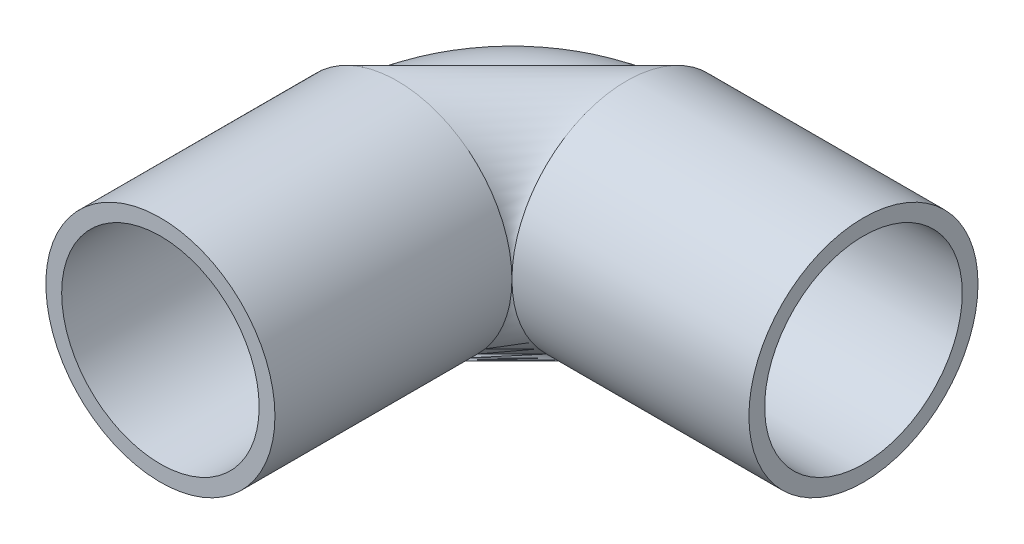
ISO-10303-21;
HEADER;
FILE_DESCRIPTION(('STEP AP214'),'2;1');
FILE_NAME('part.step','',(''),(''),'','','');
FILE_SCHEMA(('AUTOMOTIVE_DESIGN { 1 0 10303 214 1 1 1 1 }'));
ENDSEC;
DATA;
#1=APPLICATION_CONTEXT('core data for automotive mechanical design processes');
#2=APPLICATION_PROTOCOL_DEFINITION('international standard','automotive_design',2000,#1);
#3=PRODUCT_CONTEXT('',#1,'mechanical');
#4=PRODUCT('Part','Part','',(#3));
#5=PRODUCT_RELATED_PRODUCT_CATEGORY('part','',(#4));
#6=PRODUCT_DEFINITION_FORMATION('','',#4);
#7=PRODUCT_DEFINITION_CONTEXT('part definition',#1,'design');
#8=PRODUCT_DEFINITION('design','',#6,#7);
#9=PRODUCT_DEFINITION_SHAPE('','',#8);
#10=(LENGTH_UNIT() NAMED_UNIT(*) SI_UNIT(.MILLI.,.METRE.));
#11=(NAMED_UNIT(*) PLANE_ANGLE_UNIT() SI_UNIT($,.RADIAN.));
#12=(NAMED_UNIT(*) SI_UNIT($,.STERADIAN.) SOLID_ANGLE_UNIT());
#13=UNCERTAINTY_MEASURE_WITH_UNIT(LENGTH_MEASURE(1.E-05),#10,'distance_accuracy_value','');
#14=(GEOMETRIC_REPRESENTATION_CONTEXT(3) GLOBAL_UNCERTAINTY_ASSIGNED_CONTEXT((#13)) GLOBAL_UNIT_ASSIGNED_CONTEXT((#10,
#11,#12)) REPRESENTATION_CONTEXT('',''));
#15=CARTESIAN_POINT('',(0.,0.,0.));
#16=DIRECTION('',(0.,0.,1.));
#17=DIRECTION('',(1.,0.,0.));
#18=AXIS2_PLACEMENT_3D('',#15,#16,#17);
#19=CARTESIAN_POINT('',(0.,0.,30.));
#20=DIRECTION('',(0.,0.,1.));
#21=DIRECTION('',(1.,0.,0.));
#22=AXIS2_PLACEMENT_3D('',#19,#20,#21);
#23=PLANE('',#22);
#24=CARTESIAN_POINT('',(0.,0.,30.));
#25=DIRECTION('',(0.,0.,1.));
#26=DIRECTION('',(1.,0.,0.));
#27=AXIS2_PLACEMENT_3D('',#24,#25,#26);
#28=CIRCLE('',#27,14.5);
#29=CARTESIAN_POINT('',(14.5,0.,30.));
#30=VERTEX_POINT('',#29);
#31=EDGE_CURVE('E11',#30,#30,#28,.T.);
#32=ORIENTED_EDGE('',*,*,#31,.T.);
#33=EDGE_LOOP('',(#32));
#34=FACE_BOUND('',#33,.T.);
#35=CARTESIAN_POINT('',(0.,0.,30.));
#36=DIRECTION('',(0.,0.,1.));
#37=DIRECTION('',(1.,0.,0.));
#38=AXIS2_PLACEMENT_3D('',#35,#36,#37);
#39=CIRCLE('',#38,12.5);
#40=CARTESIAN_POINT('',(12.5,0.,30.));
#41=VERTEX_POINT('',#40);
#42=EDGE_CURVE('E82',#41,#41,#39,.T.);
#43=ORIENTED_EDGE('',*,*,#42,.F.);
#44=EDGE_LOOP('',(#43));
#45=FACE_BOUND('',#44,.T.);
#46=ADVANCED_FACE('F43',(#34,#45),#23,.T.);
#47=CARTESIAN_POINT('',(0.,0.,30.));
#48=DIRECTION('',(0.,0.,-1.));
#49=DIRECTION('',(-1.,0.,0.));
#50=AXIS2_PLACEMENT_3D('',#47,#48,#49);
#51=CYLINDRICAL_SURFACE('',#50,14.5);
#52=ORIENTED_EDGE('',*,*,#31,.F.);
#53=EDGE_LOOP('',(#52));
#54=FACE_BOUND('',#53,.T.);
#55=CARTESIAN_POINT('',(0.,0.,0.));
#56=DIRECTION('',(0.,0.,1.));
#57=DIRECTION('',(1.,0.,0.));
#58=AXIS2_PLACEMENT_3D('',#55,#56,#57);
#59=CIRCLE('',#58,14.5);
#60=CARTESIAN_POINT('',(14.5,0.,0.));
#61=VERTEX_POINT('',#60);
#62=EDGE_CURVE('E52',#61,#61,#59,.T.);
#63=ORIENTED_EDGE('',*,*,#62,.T.);
#64=EDGE_LOOP('',(#63));
#65=FACE_BOUND('',#64,.T.);
#66=ADVANCED_FACE('F45',(#54,#65),#51,.T.);
#67=CARTESIAN_POINT('',(0.,0.,30.));
#68=DIRECTION('',(0.,0.,-1.));
#69=DIRECTION('',(-1.,0.,0.));
#70=AXIS2_PLACEMENT_3D('',#67,#68,#69);
#71=CYLINDRICAL_SURFACE('',#70,12.5);
#72=ORIENTED_EDGE('',*,*,#42,.T.);
#73=EDGE_LOOP('',(#72));
#74=FACE_BOUND('',#73,.T.);
#75=CARTESIAN_POINT('',(-12.5073102399763,0.,0.));
#76=CARTESIAN_POINT('',(-12.5073145811233,-0.204650591903823,0.));
#77=CARTESIAN_POINT('',(-12.5022875183735,-0.409300814418579,0.));
#78=CARTESIAN_POINT('',(-12.4822017557,-0.8181084367157,0.));
#79=CARTESIAN_POINT('',(-12.4671430557762,-1.02226583649807,0.));
#80=CARTESIAN_POINT('',(-12.4270251893742,-1.42959572937615,0.));
#81=CARTESIAN_POINT('',(-12.4019660228959,-1.63276822247187,0.));
#82=CARTESIAN_POINT('',(-12.3419089615572,-2.0376389088724,0.));
#83=CARTESIAN_POINT('',(-12.3069110666967,-2.2393371021772,0.));
#84=CARTESIAN_POINT('',(-12.227060494914,-2.64077326236801,0.));
#85=CARTESIAN_POINT('',(-12.1822078179917,-2.84051122925402,0.));
#86=CARTESIAN_POINT('',(-12.0827558343626,-3.23754575517675,0.));
#87=CARTESIAN_POINT('',(-12.0281565276558,-3.43484231421347,0.));
#88=CARTESIAN_POINT('',(-11.9093427926438,-3.82651871845245,0.));
#89=CARTESIAN_POINT('',(-11.8451283643387,-4.02089856365471,0.));
#90=CARTESIAN_POINT('',(-11.7072390913664,-4.40627326249856,0.));
#91=CARTESIAN_POINT('',(-11.6335642466992,-4.59726811614015,0.));
#92=CARTESIAN_POINT('',(-11.4769316282667,-4.9754127084382,0.));
#93=CARTESIAN_POINT('',(-11.3939738545014,-5.16256244709466,0.));
#94=CARTESIAN_POINT('',(-11.2189752309222,-5.53256594933454,0.));
#95=CARTESIAN_POINT('',(-11.1269343811084,-5.71541971291795,0.));
#96=CARTESIAN_POINT('',(-10.9339913397657,-6.07639075427249,0.));
#97=CARTESIAN_POINT('',(-10.8330891482367,-6.25450803204362,0.));
#98=CARTESIAN_POINT('',(-10.6226665057174,-6.60557700165199,0.));
#99=CARTESIAN_POINT('',(-10.513146054727,-6.77852869348924,0.));
#100=CARTESIAN_POINT('',(-10.2857507376345,-7.11884983545495,0.));
#101=CARTESIAN_POINT('',(-10.1678758715323,-7.28621928558343,0.));
#102=CARTESIAN_POINT('',(-9.92405569509567,-7.61497273646653,0.));
#103=CARTESIAN_POINT('',(-9.79811038476127,-7.77635673722117,0.));
#104=CARTESIAN_POINT('',(-9.53845273314371,-8.09275050116317,0.));
#105=CARTESIAN_POINT('',(-9.40474039186054,-8.24776026435054,0.));
#106=CARTESIAN_POINT('',(-9.12987080308757,-8.55103212106127,0.));
#107=CARTESIAN_POINT('',(-8.98871355559777,-8.69929421458462,0.));
#108=CARTESIAN_POINT('',(-8.69929421458462,-8.98871355559777,0.));
#109=CARTESIAN_POINT('',(-8.55103212106127,-9.12987080308758,0.));
#110=CARTESIAN_POINT('',(-8.24776026435054,-9.40474039186052,0.));
#111=CARTESIAN_POINT('',(-8.09275050116317,-9.53845273314367,0.));
#112=CARTESIAN_POINT('',(-7.77635673722117,-9.79811038476132,0.));
#113=CARTESIAN_POINT('',(-7.61497273646654,-9.92405569509583,0.));
#114=CARTESIAN_POINT('',(-7.28621928558341,-10.1678758715321,0.));
#115=CARTESIAN_POINT('',(-7.11884983545492,-10.2857507376339,0.));
#116=CARTESIAN_POINT('',(-6.77852869348926,-10.5131460547276,0.));
#117=CARTESIAN_POINT('',(-6.6055770016521,-10.6226665057196,0.));
#118=CARTESIAN_POINT('',(-6.25450803204351,-10.8330891482345,0.));
#119=CARTESIAN_POINT('',(-6.07639075427208,-10.9339913397574,0.));
#120=CARTESIAN_POINT('',(-5.71541971291835,-11.1269343811167,0.));
#121=CARTESIAN_POINT('',(-5.53256594933605,-11.2189752309531,0.));
#122=CARTESIAN_POINT('',(-5.16256244709314,-11.3939738544705,0.));
#123=CARTESIAN_POINT('',(-4.97541270843253,-11.4769316281513,0.));
#124=CARTESIAN_POINT('',(-4.59726811614581,-11.6335642468145,0.));
#125=CARTESIAN_POINT('',(-4.4062732625197,-11.7072390917969,0.));
#126=CARTESIAN_POINT('',(-4.02089856363355,-11.8451283639082,0.));
#127=CARTESIAN_POINT('',(-3.82651871837351,-11.9093427910372,0.));
#128=CARTESIAN_POINT('',(-3.43484231429239,-12.0281565292625,0.));
#129=CARTESIAN_POINT('',(-3.23754575547131,-12.0827558403587,0.));
#130=CARTESIAN_POINT('',(-2.84051122895944,-12.1822078119957,0.));
#131=CARTESIAN_POINT('',(-2.64077326126866,-12.2270604725364,0.));
#132=CARTESIAN_POINT('',(-2.23933710327654,-12.3069110890744,0.));
#133=CARTESIAN_POINT('',(-2.0376389129752,-12.3419090450717,0.));
#134=CARTESIAN_POINT('',(-1.63276821836907,-12.4019659393814,0.));
#135=CARTESIAN_POINT('',(-1.42959571406428,-12.4270248776938,0.));
#136=CARTESIAN_POINT('',(-1.02226585180993,-12.4671433674566,0.));
#137=CARTESIAN_POINT('',(-0.818108493860382,-12.4822029189068,0.));
#138=CARTESIAN_POINT('',(-0.409300757273886,-12.5022863551667,0.));
#139=CARTESIAN_POINT('',(-0.204650378636942,-12.5073102399763,0.));
#140=CARTESIAN_POINT('',(0.204650378636946,-12.5073102399763,0.));
#141=CARTESIAN_POINT('',(0.40930075727389,-12.5022863551667,0.));
#142=CARTESIAN_POINT('',(0.818108493860385,-12.4822029189068,0.));
#143=CARTESIAN_POINT('',(1.02226585180994,-12.4671433674566,0.));
#144=CARTESIAN_POINT('',(1.42959571406428,-12.4270248776938,0.));
#145=CARTESIAN_POINT('',(1.63276821836907,-12.4019659393814,0.));
#146=CARTESIAN_POINT('',(2.0376389129752,-12.3419090450717,0.));
#147=CARTESIAN_POINT('',(2.23933710327654,-12.3069110890744,0.));
#148=CARTESIAN_POINT('',(2.64077326126866,-12.2270604725364,0.));
#149=CARTESIAN_POINT('',(2.84051122895945,-12.1822078119957,0.));
#150=CARTESIAN_POINT('',(3.23754575547132,-12.0827558403587,0.));
#151=CARTESIAN_POINT('',(3.4348423142924,-12.0281565292625,0.));
#152=CARTESIAN_POINT('',(3.82651871837352,-11.9093427910372,0.));
#153=CARTESIAN_POINT('',(4.02089856363356,-11.8451283639082,0.));
#154=CARTESIAN_POINT('',(4.40627326251971,-11.7072390917969,0.));
#155=CARTESIAN_POINT('',(4.59726811614582,-11.6335642468145,0.));
#156=CARTESIAN_POINT('',(4.97541270843254,-11.4769316281513,0.));
#157=CARTESIAN_POINT('',(5.16256244709315,-11.3939738544705,0.));
#158=CARTESIAN_POINT('',(5.53256594933606,-11.2189752309531,0.));
#159=CARTESIAN_POINT('',(5.71541971291836,-11.1269343811167,0.));
#160=CARTESIAN_POINT('',(6.07639075427209,-10.9339913397574,0.));
#161=CARTESIAN_POINT('',(6.25450803204351,-10.8330891482345,0.));
#162=CARTESIAN_POINT('',(6.6055770016521,-10.6226665057196,0.));
#163=CARTESIAN_POINT('',(6.77852869348927,-10.5131460547276,0.));
#164=CARTESIAN_POINT('',(7.11884983545493,-10.2857507376339,0.));
#165=CARTESIAN_POINT('',(7.28621928558342,-10.1678758715321,0.));
#166=CARTESIAN_POINT('',(7.61497273646654,-9.92405569509583,0.));
#167=CARTESIAN_POINT('',(7.77635673722117,-9.79811038476132,0.));
#168=CARTESIAN_POINT('',(8.09275050116317,-9.53845273314366,0.));
#169=CARTESIAN_POINT('',(8.24776026435054,-9.40474039186052,0.));
#170=CARTESIAN_POINT('',(8.55103212106127,-9.12987080308758,0.));
#171=CARTESIAN_POINT('',(8.69929421458462,-8.98871355559777,0.));
#172=CARTESIAN_POINT('',(8.98871355559777,-8.69929421458462,0.));
#173=CARTESIAN_POINT('',(9.12987080308758,-8.55103212106127,0.));
#174=CARTESIAN_POINT('',(9.40474039186053,-8.24776026435054,0.));
#175=CARTESIAN_POINT('',(9.53845273314367,-8.09275050116317,0.));
#176=CARTESIAN_POINT('',(9.79811038476132,-7.77635673722116,0.));
#177=CARTESIAN_POINT('',(9.92405569509583,-7.61497273646654,0.));
#178=CARTESIAN_POINT('',(10.1678758715321,-7.28621928558342,0.));
#179=CARTESIAN_POINT('',(10.2857507376339,-7.11884983545492,0.));
#180=CARTESIAN_POINT('',(10.5131460547276,-6.77852869348927,0.));
#181=CARTESIAN_POINT('',(10.6226665057196,-6.6055770016521,0.));
#182=CARTESIAN_POINT('',(10.8330891482345,-6.25450803204351,0.));
#183=CARTESIAN_POINT('',(10.9339913397574,-6.07639075427208,0.));
#184=CARTESIAN_POINT('',(11.1269343811167,-5.71541971291835,0.));
#185=CARTESIAN_POINT('',(11.2189752309531,-5.53256594933605,0.));
#186=CARTESIAN_POINT('',(11.3939738544705,-5.16256244709314,0.));
#187=CARTESIAN_POINT('',(11.4769316281513,-4.97541270843253,0.));
#188=CARTESIAN_POINT('',(11.6335642468145,-4.59726811614581,0.));
#189=CARTESIAN_POINT('',(11.7072390917969,-4.40627326251971,0.));
#190=CARTESIAN_POINT('',(11.8451283639082,-4.02089856363356,0.));
#191=CARTESIAN_POINT('',(11.9093427910372,-3.82651871837352,0.));
#192=CARTESIAN_POINT('',(12.0281565292625,-3.43484231429239,0.));
#193=CARTESIAN_POINT('',(12.0827558403587,-3.23754575547131,0.));
#194=CARTESIAN_POINT('',(12.1822078119957,-2.84051122895945,0.));
#195=CARTESIAN_POINT('',(12.2270604725364,-2.64077326126866,0.));
#196=CARTESIAN_POINT('',(12.3069110890744,-2.23933710327653,0.));
#197=CARTESIAN_POINT('',(12.3419090450717,-2.03763891297519,0.));
#198=CARTESIAN_POINT('',(12.4019659393814,-1.63276821836906,0.));
#199=CARTESIAN_POINT('',(12.4270248776938,-1.42959571406428,0.));
#200=CARTESIAN_POINT('',(12.4671433674566,-1.02226585180994,0.));
#201=CARTESIAN_POINT('',(12.4822029189068,-0.818108493860384,0.));
#202=CARTESIAN_POINT('',(12.5022863551667,-0.409300757273887,0.));
#203=CARTESIAN_POINT('',(12.5073102399763,-0.204650378636943,0.));
#204=CARTESIAN_POINT('',(12.5073102399763,0.204650378636946,0.));
#205=CARTESIAN_POINT('',(12.5022863551667,0.40930075727389,0.));
#206=CARTESIAN_POINT('',(12.4822029189068,0.818108493860388,0.));
#207=CARTESIAN_POINT('',(12.4671433674565,1.02226585180994,0.));
#208=CARTESIAN_POINT('',(12.4270248776938,1.42959571406428,0.));
#209=CARTESIAN_POINT('',(12.4019659393814,1.63276821836907,0.));
#210=CARTESIAN_POINT('',(12.3419090450717,2.03763891297519,0.));
#211=CARTESIAN_POINT('',(12.3069110890744,2.23933710327654,0.));
#212=CARTESIAN_POINT('',(12.2270604725364,2.64077326126866,0.));
#213=CARTESIAN_POINT('',(12.1822078119957,2.84051122895945,0.));
#214=CARTESIAN_POINT('',(12.0827558403587,3.23754575547131,0.));
#215=CARTESIAN_POINT('',(12.0281565292625,3.4348423142924,0.));
#216=CARTESIAN_POINT('',(11.9093427910372,3.82651871837352,0.));
#217=CARTESIAN_POINT('',(11.8451283639082,4.02089856363356,0.));
#218=CARTESIAN_POINT('',(11.7072390917969,4.40627326251971,0.));
#219=CARTESIAN_POINT('',(11.6335642468145,4.59726811614581,0.));
#220=CARTESIAN_POINT('',(11.4769316281513,4.97541270843253,0.));
#221=CARTESIAN_POINT('',(11.3939738544705,5.16256244709314,0.));
#222=CARTESIAN_POINT('',(11.2189752309531,5.53256594933605,0.));
#223=CARTESIAN_POINT('',(11.1269343811167,5.71541971291836,0.));
#224=CARTESIAN_POINT('',(10.9339913397574,6.07639075427209,0.));
#225=CARTESIAN_POINT('',(10.8330891482345,6.25450803204351,0.));
#226=CARTESIAN_POINT('',(10.6226665057196,6.6055770016521,0.));
#227=CARTESIAN_POINT('',(10.5131460547276,6.77852869348927,0.));
#228=CARTESIAN_POINT('',(10.2857507376339,7.11884983545493,0.));
#229=CARTESIAN_POINT('',(10.1678758715321,7.28621928558342,0.));
#230=CARTESIAN_POINT('',(9.92405569509583,7.61497273646654,0.));
#231=CARTESIAN_POINT('',(9.79811038476132,7.77635673722117,0.));
#232=CARTESIAN_POINT('',(9.53845273314367,8.09275050116317,0.));
#233=CARTESIAN_POINT('',(9.40474039186052,8.24776026435054,0.));
#234=CARTESIAN_POINT('',(9.12987080308758,8.55103212106127,0.));
#235=CARTESIAN_POINT('',(8.98871355559777,8.69929421458462,0.));
#236=CARTESIAN_POINT('',(8.69929421458462,8.98871355559777,0.));
#237=CARTESIAN_POINT('',(8.55103212106127,9.12987080308758,0.));
#238=CARTESIAN_POINT('',(8.24776026435054,9.40474039186052,0.));
#239=CARTESIAN_POINT('',(8.09275050116317,9.53845273314367,0.));
#240=CARTESIAN_POINT('',(7.77635673722116,9.79811038476132,0.));
#241=CARTESIAN_POINT('',(7.61497273646654,9.92405569509583,0.));
#242=CARTESIAN_POINT('',(7.28621928558342,10.1678758715321,0.));
#243=CARTESIAN_POINT('',(7.11884983545493,10.2857507376339,0.));
#244=CARTESIAN_POINT('',(6.77852869348927,10.5131460547276,0.));
#245=CARTESIAN_POINT('',(6.6055770016521,10.6226665057196,0.));
#246=CARTESIAN_POINT('',(6.25450803204351,10.8330891482345,0.));
#247=CARTESIAN_POINT('',(6.07639075427208,10.9339913397574,0.));
#248=CARTESIAN_POINT('',(5.71541971291836,11.1269343811167,0.));
#249=CARTESIAN_POINT('',(5.53256594933605,11.2189752309531,0.));
#250=CARTESIAN_POINT('',(5.16256244709314,11.3939738544705,0.));
#251=CARTESIAN_POINT('',(4.97541270843253,11.4769316281513,0.));
#252=CARTESIAN_POINT('',(4.59726811614581,11.6335642468145,0.));
#253=CARTESIAN_POINT('',(4.40627326251971,11.7072390917969,0.));
#254=CARTESIAN_POINT('',(4.02089856363356,11.8451283639082,0.));
#255=CARTESIAN_POINT('',(3.82651871837352,11.9093427910372,0.));
#256=CARTESIAN_POINT('',(3.43484231429239,12.0281565292625,0.));
#257=CARTESIAN_POINT('',(3.23754575547131,12.0827558403587,0.));
#258=CARTESIAN_POINT('',(2.84051122895944,12.1822078119957,0.));
#259=CARTESIAN_POINT('',(2.64077326126866,12.2270604725364,0.));
#260=CARTESIAN_POINT('',(2.23933710327653,12.3069110890744,0.));
#261=CARTESIAN_POINT('',(2.03763891297519,12.3419090450717,0.));
#262=CARTESIAN_POINT('',(1.63276821836906,12.4019659393814,0.));
#263=CARTESIAN_POINT('',(1.42959571406428,12.4270248776938,0.));
#264=CARTESIAN_POINT('',(1.02226585180994,12.4671433674566,0.));
#265=CARTESIAN_POINT('',(0.818108493860387,12.4822029189068,0.));
#266=CARTESIAN_POINT('',(0.409300757273889,12.5022863551667,0.));
#267=CARTESIAN_POINT('',(0.204650378636945,12.5073102399763,0.));
#268=CARTESIAN_POINT('',(-0.204650378636945,12.5073102399763,0.));
#269=CARTESIAN_POINT('',(-0.40930075727389,12.5022863551667,0.));
#270=CARTESIAN_POINT('',(-0.818108493860388,12.4822029189068,0.));
#271=CARTESIAN_POINT('',(-1.02226585180994,12.4671433674565,0.));
#272=CARTESIAN_POINT('',(-1.42959571406428,12.4270248776938,0.));
#273=CARTESIAN_POINT('',(-1.63276821836907,12.4019659393814,0.));
#274=CARTESIAN_POINT('',(-2.03763891297519,12.3419090450717,0.));
#275=CARTESIAN_POINT('',(-2.23933710327653,12.3069110890744,0.));
#276=CARTESIAN_POINT('',(-2.64077326126866,12.2270604725364,0.));
#277=CARTESIAN_POINT('',(-2.84051122895945,12.1822078119957,0.));
#278=CARTESIAN_POINT('',(-3.23754575547131,12.0827558403587,0.));
#279=CARTESIAN_POINT('',(-3.43484231429239,12.0281565292625,0.));
#280=CARTESIAN_POINT('',(-3.82651871837352,11.9093427910372,0.));
#281=CARTESIAN_POINT('',(-4.02089856363356,11.8451283639082,0.));
#282=CARTESIAN_POINT('',(-4.40627326251971,11.7072390917969,0.));
#283=CARTESIAN_POINT('',(-4.59726811614581,11.6335642468145,0.));
#284=CARTESIAN_POINT('',(-4.97541270843253,11.4769316281513,0.));
#285=CARTESIAN_POINT('',(-5.16256244709314,11.3939738544705,0.));
#286=CARTESIAN_POINT('',(-5.53256594933606,11.2189752309531,0.));
#287=CARTESIAN_POINT('',(-5.71541971291836,11.1269343811167,0.));
#288=CARTESIAN_POINT('',(-6.07639075427208,10.9339913397574,0.));
#289=CARTESIAN_POINT('',(-6.25450803204351,10.8330891482345,0.));
#290=CARTESIAN_POINT('',(-6.6055770016521,10.6226665057196,0.));
#291=CARTESIAN_POINT('',(-6.77852869348927,10.5131460547276,0.));
#292=CARTESIAN_POINT('',(-7.11884983545493,10.2857507376339,0.));
#293=CARTESIAN_POINT('',(-7.28621928558342,10.1678758715321,0.));
#294=CARTESIAN_POINT('',(-7.61497273646654,9.92405569509583,0.));
#295=CARTESIAN_POINT('',(-7.77635673722117,9.79811038476132,0.));
#296=CARTESIAN_POINT('',(-8.09275050116317,9.53845273314367,0.));
#297=CARTESIAN_POINT('',(-8.24776026435054,9.40474039186052,0.));
#298=CARTESIAN_POINT('',(-8.55103212106127,9.12987080308758,0.));
#299=CARTESIAN_POINT('',(-8.69929421458462,8.98871355559777,0.));
#300=CARTESIAN_POINT('',(-8.98871355559777,8.69929421458462,0.));
#301=CARTESIAN_POINT('',(-9.12987080308757,8.55103212106127,0.));
#302=CARTESIAN_POINT('',(-9.40474039186054,8.24776026435054,0.));
#303=CARTESIAN_POINT('',(-9.53845273314371,8.09275050116317,0.));
#304=CARTESIAN_POINT('',(-9.79811038476128,7.77635673722116,0.));
#305=CARTESIAN_POINT('',(-9.92405569509567,7.61497273646653,0.));
#306=CARTESIAN_POINT('',(-10.1678758715323,7.28621928558343,0.));
#307=CARTESIAN_POINT('',(-10.2857507376345,7.11884983545496,0.));
#308=CARTESIAN_POINT('',(-10.513146054727,6.77852869348924,0.));
#309=CARTESIAN_POINT('',(-10.6226665057174,6.60557700165199,0.));
#310=CARTESIAN_POINT('',(-10.8330891482367,6.25450803204362,0.));
#311=CARTESIAN_POINT('',(-10.9339913397657,6.07639075427249,0.));
#312=CARTESIAN_POINT('',(-11.1269343811084,5.71541971291795,0.));
#313=CARTESIAN_POINT('',(-11.2189752309222,5.53256594933454,0.));
#314=CARTESIAN_POINT('',(-11.3939738545014,5.16256244709466,0.));
#315=CARTESIAN_POINT('',(-11.4769316282667,4.9754127084382,0.));
#316=CARTESIAN_POINT('',(-11.6335642466992,4.59726811614015,0.));
#317=CARTESIAN_POINT('',(-11.7072390913664,4.40627326249856,0.));
#318=CARTESIAN_POINT('',(-11.8451283643387,4.02089856365471,0.));
#319=CARTESIAN_POINT('',(-11.9093427926438,3.82651871845245,0.));
#320=CARTESIAN_POINT('',(-12.0281565276558,3.43484231421347,0.));
#321=CARTESIAN_POINT('',(-12.0827558343626,3.23754575517674,0.));
#322=CARTESIAN_POINT('',(-12.1822078179917,2.84051122925401,0.));
#323=CARTESIAN_POINT('',(-12.227060494914,2.640773262368,0.));
#324=CARTESIAN_POINT('',(-12.3069110666967,2.23933710217719,0.));
#325=CARTESIAN_POINT('',(-12.3419089615572,2.03763890887239,0.));
#326=CARTESIAN_POINT('',(-12.4019660228959,1.63276822247187,0.));
#327=CARTESIAN_POINT('',(-12.4270251893742,1.42959572937615,0.));
#328=CARTESIAN_POINT('',(-12.4671430557762,1.02226583649807,0.));
#329=CARTESIAN_POINT('',(-12.4822017557,0.8181084367157,0.));
#330=CARTESIAN_POINT('',(-12.5022875183735,0.409300814418577,0.));
#331=CARTESIAN_POINT('',(-12.5073145811233,0.204650591903821,0.));
#332=CARTESIAN_POINT('',(-12.5073102399763,0.,0.));
#333=B_SPLINE_CURVE_WITH_KNOTS('',3,(#75,#76,#77,#78,#79,#80,#81,#82,#83,#84,#85,#86,#87,#88,
#89,#90,#91,#92,#93,#94,#95,#96,#97,#98,#99,#100,#101,#102,#103,#104,#105,#106,#107,#108,#109,
#110,#111,#112,#113,#114,#115,#116,#117,#118,#119,#120,#121,#122,#123,#124,#125,#126,#127,#128,
#129,#130,#131,#132,#133,#134,#135,#136,#137,#138,#139,#140,#141,#142,#143,#144,#145,#146,#147,
#148,#149,#150,#151,#152,#153,#154,#155,#156,#157,#158,#159,#160,#161,#162,#163,#164,#165,#166,
#167,#168,#169,#170,#171,#172,#173,#174,#175,#176,#177,#178,#179,#180,#181,#182,#183,#184,#185,
#186,#187,#188,#189,#190,#191,#192,#193,#194,#195,#196,#197,#198,#199,#200,#201,#202,#203,#204,
#205,#206,#207,#208,#209,#210,#211,#212,#213,#214,#215,#216,#217,#218,#219,#220,#221,#222,#223,
#224,#225,#226,#227,#228,#229,#230,#231,#232,#233,#234,#235,#236,#237,#238,#239,#240,#241,#242,
#243,#244,#245,#246,#247,#248,#249,#250,#251,#252,#253,#254,#255,#256,#257,#258,#259,#260,#261,
#262,#263,#264,#265,#266,#267,#268,#269,#270,#271,#272,#273,#274,#275,#276,#277,#278,#279,#280,
#281,#282,#283,#284,#285,#286,#287,#288,#289,#290,#291,#292,#293,#294,#295,#296,#297,#298,#299,
#300,#301,#302,#303,#304,#305,#306,#307,#308,#309,#310,#311,#312,#313,#314,#315,#316,#317,#318,
#319,#320,#321,#322,#323,#324,#325,#326,#327,#328,#329,#330,#331,#332),.UNSPECIFIED.,.F.,.F.,(4,
2,2,2,2,2,2,2,2,2,2,2,2,2,2,2,2,2,2,2,2,2,2,2,2,2,2,2,2,2,2,2,2,2,2,2,2,2,2,2,2,2,2,2,2,2,2,2,2,
2,2,2,2,2,2,2,2,2,2,2,2,2,2,2,2,2,2,2,2,2,2,2,2,2,2,2,2,2,2,2,2,2,2,2,2,2,2,2,2,2,2,2,2,2,2,2,2,
2,2,2,2,2,2,2,2,2,2,2,2,2,2,2,2,2,2,2,2,2,2,2,2,2,2,2,2,2,2,2,4),(0.,0.613889517612437,
1.22777903522487,1.84166855283732,2.45555807044976,3.0694475880622,3.68333710567463,
4.29722662328707,4.91111614089952,5.52500565851196,6.13889517612439,6.75278469373683,
7.36667421134927,7.9805637289617,8.59445324657415,9.20834276418659,9.82223228179902,
10.4361217994115,11.0500113170239,11.6639008346363,12.2777903522488,12.8916798698612,
13.5055693874737,14.1194589050861,14.7333484226985,15.347237940311,15.9611274579234,
16.5750169755359,17.1889064931483,17.8027960107607,18.4166855283732,19.0305750459856,
19.644464563598,20.2583540812105,20.8722435988229,21.4861331164354,22.1000226340478,
22.7139121516602,23.3278016692727,23.9416911868851,24.5555807044976,25.16947022211,
25.7833597397224,26.3972492573349,27.0111387749473,27.6250282925598,28.2389178101722,
28.8528073277846,29.4666968453971,30.0805863630095,30.694475880622,31.3083653982344,
31.9222549158468,32.5361444334593,33.1500339510717,33.7639234686842,34.3778129862966,
34.991702503909,35.6055920215215,36.2194815391339,36.8333710567464,37.4472605743588,
38.0611500919712,38.6750396095837,39.2889291271961,39.9028186448086,40.516708162421,
41.1305976800335,41.7444871976459,42.3583767152583,42.9722662328708,43.5861557504832,
44.2000452680957,44.8139347857081,45.4278243033205,46.041713820933,46.6556033385454,
47.2694928561579,47.8833823737703,48.4972718913828,49.1111614089952,49.7250509266076,
50.3389404442201,50.9528299618325,51.566719479445,52.1806089970574,52.7944985146698,
53.4083880322823,54.0222775498947,54.6361670675072,55.2500565851196,55.863946102732,
56.4778356203445,57.0917251379569,57.7056146555693,58.3195041731818,58.9333936907942,
59.5472832084067,60.1611727260191,60.7750622436315,61.388951761244,62.0028412788564,
62.6167307964689,63.2306203140813,63.8445098316937,64.4583993493062,65.0722888669186,
65.6861783845311,66.3000679021435,66.9139574197559,67.5278469373684,68.1417364549808,
68.7556259725933,69.3695154902057,69.9834050078182,70.5972945254306,71.211184043043,
71.8250735606555,72.4389630782679,73.0528525958804,73.6667421134928,74.2806316311053,
74.8945211487177,75.5084106663301,76.1223001839426,76.736189701555,77.3500792191675,
77.9639687367799,78.5778582543924),.UNSPECIFIED.);
#334=CARTESIAN_POINT('',(-12.5073102399763,0.,0.));
#335=VERTEX_POINT('',#334);
#336=EDGE_CURVE('E63',#335,#335,#333,.T.);
#337=ORIENTED_EDGE('',*,*,#336,.F.);
#338=EDGE_LOOP('',(#337));
#339=FACE_BOUND('',#338,.T.);
#340=ADVANCED_FACE('F95',(#74,#339),#71,.F.);
#341=CARTESIAN_POINT('',(14.5,0.,0.));
#342=DIRECTION('',(0.,1.,0.));
#343=DIRECTION('',(0.,0.,1.));
#344=AXIS2_PLACEMENT_3D('',#341,#342,#343);
#345=DEGENERATE_TOROIDAL_SURFACE('',#344,14.5,14.5,.T.);
#346=CARTESIAN_POINT('',(14.5,0.,-14.5));
#347=DIRECTION('',(1.,0.,0.));
#348=DIRECTION('',(0.,0.,-1.));
#349=AXIS2_PLACEMENT_3D('',#346,#347,#348);
#350=CIRCLE('',#349,14.5);
#351=EDGE_CURVE('E47',#61,#61,#350,.T.);
#352=ORIENTED_EDGE('',*,*,#351,.F.);
#353=ORIENTED_EDGE('',*,*,#62,.F.);
#354=EDGE_LOOP('',(#352,#353));
#355=FACE_BOUND('',#354,.T.);
#356=ADVANCED_FACE('F94',(#355),#345,.T.);
#357=CARTESIAN_POINT('',(14.5,0.,0.));
#358=DIRECTION('',(0.,1.,0.));
#359=DIRECTION('',(0.,0.,1.));
#360=AXIS2_PLACEMENT_3D('',#357,#358,#359);
#361=TOROIDAL_SURFACE('',#360,14.5,12.5073102399763);
#362=ORIENTED_EDGE('',*,*,#336,.T.);
#363=EDGE_LOOP('',(#362));
#364=FACE_BOUND('',#363,.T.);
#365=CARTESIAN_POINT('',(14.5,0.,-14.5));
#366=DIRECTION('',(1.,0.,0.));
#367=DIRECTION('',(0.,0.,-1.));
#368=AXIS2_PLACEMENT_3D('',#365,#366,#367);
#369=CIRCLE('',#368,12.5073102399763);
#370=CARTESIAN_POINT('',(14.5,0.,-27.0073102399763));
#371=VERTEX_POINT('',#370);
#372=EDGE_CURVE('E60',#371,#371,#369,.F.);
#373=ORIENTED_EDGE('',*,*,#372,.F.);
#374=EDGE_LOOP('',(#373));
#375=FACE_BOUND('',#374,.T.);
#376=ADVANCED_FACE('F83',(#364,#375),#361,.F.);
#377=CARTESIAN_POINT('',(44.5,0.,-14.5));
#378=DIRECTION('',(1.,0.,0.));
#379=DIRECTION('',(0.,0.,-1.));
#380=AXIS2_PLACEMENT_3D('',#377,#378,#379);
#381=PLANE('',#380);
#382=CARTESIAN_POINT('',(44.5,0.,-14.5));
#383=DIRECTION('',(1.,0.,0.));
#384=DIRECTION('',(0.,0.,-1.));
#385=AXIS2_PLACEMENT_3D('',#382,#383,#384);
#386=CIRCLE('',#385,14.5);
#387=CARTESIAN_POINT('',(44.5,0.,-29.));
#388=VERTEX_POINT('',#387);
#389=EDGE_CURVE('E61',#388,#388,#386,.T.);
#390=ORIENTED_EDGE('',*,*,#389,.T.);
#391=EDGE_LOOP('',(#390));
#392=FACE_BOUND('',#391,.T.);
#393=CARTESIAN_POINT('',(44.5,0.,-14.5));
#394=DIRECTION('',(1.,0.,0.));
#395=DIRECTION('',(0.,0.,-1.));
#396=AXIS2_PLACEMENT_3D('',#393,#394,#395);
#397=CIRCLE('',#396,12.5073102399763);
#398=CARTESIAN_POINT('',(44.5,0.,-27.0073102399763));
#399=VERTEX_POINT('',#398);
#400=EDGE_CURVE('E66',#399,#399,#397,.T.);
#401=ORIENTED_EDGE('',*,*,#400,.F.);
#402=EDGE_LOOP('',(#401));
#403=FACE_BOUND('',#402,.T.);
#404=ADVANCED_FACE('F93',(#392,#403),#381,.T.);
#405=CARTESIAN_POINT('',(44.5,0.,-14.5));
#406=DIRECTION('',(-1.,0.,0.));
#407=DIRECTION('',(0.,0.,1.));
#408=AXIS2_PLACEMENT_3D('',#405,#406,#407);
#409=CYLINDRICAL_SURFACE('',#408,14.5);
#410=ORIENTED_EDGE('',*,*,#389,.F.);
#411=EDGE_LOOP('',(#410));
#412=FACE_BOUND('',#411,.T.);
#413=ORIENTED_EDGE('',*,*,#351,.T.);
#414=EDGE_LOOP('',(#413));
#415=FACE_BOUND('',#414,.T.);
#416=ADVANCED_FACE('F57',(#412,#415),#409,.T.);
#417=CARTESIAN_POINT('',(44.5,0.,-14.5));
#418=DIRECTION('',(-1.,0.,0.));
#419=DIRECTION('',(0.,0.,1.));
#420=AXIS2_PLACEMENT_3D('',#417,#418,#419);
#421=CYLINDRICAL_SURFACE('',#420,12.5073102399763);
#422=ORIENTED_EDGE('',*,*,#400,.T.);
#423=EDGE_LOOP('',(#422));
#424=FACE_BOUND('',#423,.T.);
#425=ORIENTED_EDGE('',*,*,#372,.T.);
#426=EDGE_LOOP('',(#425));
#427=FACE_BOUND('',#426,.T.);
#428=ADVANCED_FACE('F152',(#424,#427),#421,.F.);
#429=CLOSED_SHELL('',(#46,#66,#340,#356,#376,#404,#416,#428));
#430=MANIFOLD_SOLID_BREP('B2',#429);
#431=ADVANCED_BREP_SHAPE_REPRESENTATION('',(#18,#430),#14);
#432=SHAPE_DEFINITION_REPRESENTATION(#9,#431);
ENDSEC;
END-ISO-10303-21;
